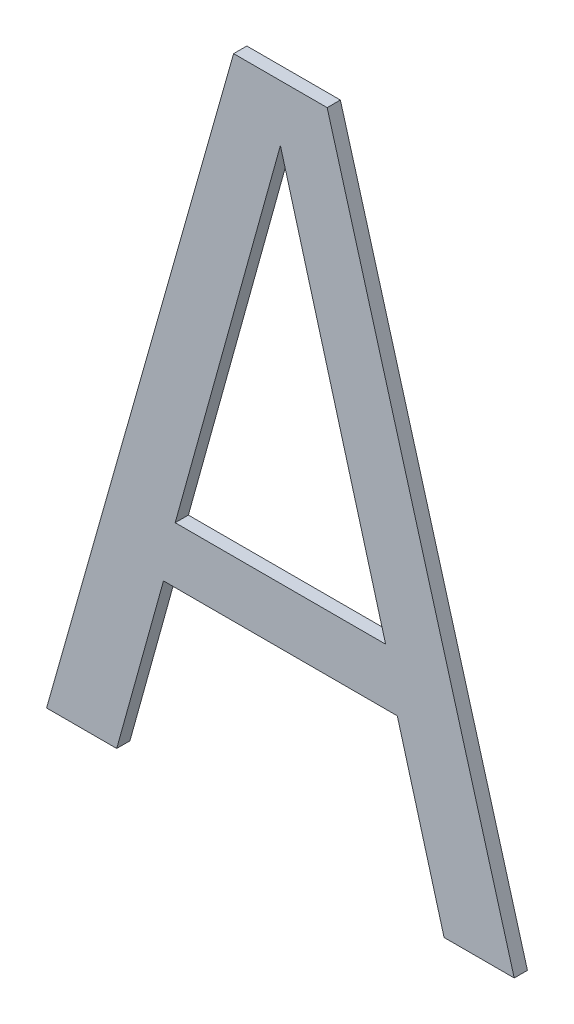
ISO-10303-21;
HEADER;
FILE_DESCRIPTION(('STEP AP214'),'2;1');
FILE_NAME('part.step','',(''),(''),'','','');
FILE_SCHEMA(('AUTOMOTIVE_DESIGN { 1 0 10303 214 1 1 1 1 }'));
ENDSEC;
DATA;
#1=APPLICATION_CONTEXT('core data for automotive mechanical design processes');
#2=APPLICATION_PROTOCOL_DEFINITION('international standard','automotive_design',2000,#1);
#3=PRODUCT_CONTEXT('',#1,'mechanical');
#4=PRODUCT('Part','Part','',(#3));
#5=PRODUCT_RELATED_PRODUCT_CATEGORY('part','',(#4));
#6=PRODUCT_DEFINITION_FORMATION('','',#4);
#7=PRODUCT_DEFINITION_CONTEXT('part definition',#1,'design');
#8=PRODUCT_DEFINITION('design','',#6,#7);
#9=PRODUCT_DEFINITION_SHAPE('','',#8);
#10=(LENGTH_UNIT() NAMED_UNIT(*) SI_UNIT(.MILLI.,.METRE.));
#11=(NAMED_UNIT(*) PLANE_ANGLE_UNIT() SI_UNIT($,.RADIAN.));
#12=(NAMED_UNIT(*) SI_UNIT($,.STERADIAN.) SOLID_ANGLE_UNIT());
#13=UNCERTAINTY_MEASURE_WITH_UNIT(LENGTH_MEASURE(1.E-05),#10,'distance_accuracy_value','');
#14=(GEOMETRIC_REPRESENTATION_CONTEXT(3) GLOBAL_UNCERTAINTY_ASSIGNED_CONTEXT((#13)) GLOBAL_UNIT_ASSIGNED_CONTEXT((#10,
#11,#12)) REPRESENTATION_CONTEXT('',''));
#15=CARTESIAN_POINT('',(0.,0.,0.));
#16=DIRECTION('',(0.,0.,1.));
#17=DIRECTION('',(1.,0.,0.));
#18=AXIS2_PLACEMENT_3D('',#15,#16,#17);
#19=CARTESIAN_POINT('',(157.622942385733,142.200586634191,5.9));
#20=DIRECTION('',(0.,0.,1.));
#21=DIRECTION('',(1.,0.,0.));
#22=AXIS2_PLACEMENT_3D('',#19,#20,#21);
#23=PLANE('',#22);
#24=DIRECTION('',(1.,0.,0.));
#25=VECTOR('',#24,1.);
#26=CARTESIAN_POINT('',(157.622942385733,143.902714239871,5.9));
#27=LINE('',#26,#25);
#28=CARTESIAN_POINT('',(159.688914575803,143.902714239871,5.9));
#29=VERTEX_POINT('',#28);
#30=CARTESIAN_POINT('',(158.095164575803,143.902714239871,5.9));
#31=VERTEX_POINT('',#30);
#32=EDGE_CURVE('E20',#29,#31,#27,.F.);
#33=ORIENTED_EDGE('',*,*,#32,.F.);
#34=DIRECTION('',(-0.267333223456103,0.963604144675898,0.));
#35=VECTOR('',#34,1.);
#36=CARTESIAN_POINT('',(158.892039575803,146.775054770021,5.9));
#37=LINE('',#36,#35);
#38=CARTESIAN_POINT('',(158.892039575803,146.775054770021,5.9));
#39=VERTEX_POINT('',#38);
#40=EDGE_CURVE('E154',#29,#39,#37,.T.);
#41=ORIENTED_EDGE('',*,*,#40,.T.);
#42=DIRECTION('',(-0.267333223456101,-0.963604144675899,0.));
#43=VECTOR('',#42,1.);
#44=CARTESIAN_POINT('',(158.095164575803,143.902714239871,5.9));
#45=LINE('',#44,#43);
#46=EDGE_CURVE('E149',#39,#31,#45,.T.);
#47=ORIENTED_EDGE('',*,*,#46,.T.);
#48=EDGE_LOOP('',(#33,#41,#47));
#49=FACE_BOUND('',#48,.T.);
#50=DIRECTION('',(0.272602692783405,0.962126692222618,0.));
#51=VECTOR('',#50,1.);
#52=CARTESIAN_POINT('',(158.537873246893,147.200586634191,5.9));
#53=LINE('',#52,#51);
#54=CARTESIAN_POINT('',(157.121205904708,142.200586634193,5.9));
#55=VERTEX_POINT('',#54);
#56=CARTESIAN_POINT('',(158.537873246893,147.200586634191,5.9));
#57=VERTEX_POINT('',#56);
#58=EDGE_CURVE('E147',#55,#57,#53,.T.);
#59=ORIENTED_EDGE('',*,*,#58,.T.);
#60=DIRECTION('',(1.,0.,0.));
#61=VECTOR('',#60,1.);
#62=CARTESIAN_POINT('',(159.246205904713,147.200586634191,5.9));
#63=LINE('',#62,#61);
#64=CARTESIAN_POINT('',(159.246205904713,147.200586634191,5.9));
#65=VERTEX_POINT('',#64);
#66=EDGE_CURVE('E141',#57,#65,#63,.T.);
#67=ORIENTED_EDGE('',*,*,#66,.T.);
#68=DIRECTION('',(0.272602692782372,-0.962126692222911,0.));
#69=VECTOR('',#68,1.);
#70=CARTESIAN_POINT('',(160.662873246893,142.200586634191,5.9));
#71=LINE('',#70,#69);
#72=CARTESIAN_POINT('',(160.662873246893,142.200586634191,5.9));
#73=VERTEX_POINT('',#72);
#74=EDGE_CURVE('E136',#65,#73,#71,.T.);
#75=ORIENTED_EDGE('',*,*,#74,.T.);
#76=DIRECTION('',(1.,0.,0.));
#77=VECTOR('',#76,1.);
#78=CARTESIAN_POINT('',(160.131623246893,142.200586634191,5.9));
#79=LINE('',#78,#77);
#80=CARTESIAN_POINT('',(160.131623246893,142.200586634191,5.9));
#81=VERTEX_POINT('',#80);
#82=EDGE_CURVE('E131',#73,#81,#79,.F.);
#83=ORIENTED_EDGE('',*,*,#82,.T.);
#84=DIRECTION('',(-0.26733370656626,0.963604010646253,0.));
#85=VECTOR('',#84,1.);
#86=CARTESIAN_POINT('',(159.777455904713,143.477182375701,5.9));
#87=LINE('',#86,#85);
#88=CARTESIAN_POINT('',(159.777455904713,143.477182375701,5.9));
#89=VERTEX_POINT('',#88);
#90=EDGE_CURVE('E127',#81,#89,#87,.T.);
#91=ORIENTED_EDGE('',*,*,#90,.T.);
#92=DIRECTION('',(1.,0.,0.));
#93=VECTOR('',#92,1.);
#94=CARTESIAN_POINT('',(158.006623246893,143.477182375701,5.9));
#95=LINE('',#94,#93);
#96=CARTESIAN_POINT('',(158.006623246893,143.477182375701,5.9));
#97=VERTEX_POINT('',#96);
#98=EDGE_CURVE('E113',#89,#97,#95,.F.);
#99=ORIENTED_EDGE('',*,*,#98,.T.);
#100=DIRECTION('',(-0.267333706566255,-0.963604010646255,0.));
#101=VECTOR('',#100,1.);
#102=CARTESIAN_POINT('',(157.652455904713,142.200586634191,5.9));
#103=LINE('',#102,#101);
#104=CARTESIAN_POINT('',(157.652455904713,142.200586634192,5.9));
#105=VERTEX_POINT('',#104);
#106=EDGE_CURVE('E98',#97,#105,#103,.T.);
#107=ORIENTED_EDGE('',*,*,#106,.T.);
#108=DIRECTION('',(1.,0.,0.));
#109=VECTOR('',#108,1.);
#110=CARTESIAN_POINT('',(157.121205904708,142.200586634193,5.9));
#111=LINE('',#110,#109);
#112=EDGE_CURVE('E103',#105,#55,#111,.F.);
#113=ORIENTED_EDGE('',*,*,#112,.T.);
#114=EDGE_LOOP('',(#59,#67,#75,#83,#91,#99,#107,#113));
#115=FACE_BOUND('',#114,.T.);
#116=ADVANCED_FACE('F17',(#49,#115),#23,.F.);
#117=CARTESIAN_POINT('',(157.121205904708,142.200586634193,6.));
#118=DIRECTION('',(0.,1.,0.));
#119=DIRECTION('',(0.,0.,1.));
#120=AXIS2_PLACEMENT_3D('',#117,#118,#119);
#121=PLANE('',#120);
#122=DIRECTION('',(0.,0.,1.));
#123=VECTOR('',#122,1.);
#124=CARTESIAN_POINT('',(157.652455904713,142.200586634191,6.));
#125=LINE('',#124,#123);
#126=CARTESIAN_POINT('',(157.652455904713,142.200586634192,6.));
#127=VERTEX_POINT('',#126);
#128=EDGE_CURVE('E105',#105,#127,#125,.T.);
#129=ORIENTED_EDGE('',*,*,#128,.T.);
#130=DIRECTION('',(1.,0.,0.));
#131=VECTOR('',#130,1.);
#132=CARTESIAN_POINT('',(157.622942385733,142.200586634193,6.));
#133=LINE('',#132,#131);
#134=CARTESIAN_POINT('',(157.121205904708,142.200586634193,6.));
#135=VERTEX_POINT('',#134);
#136=EDGE_CURVE('E161',#135,#127,#133,.T.);
#137=ORIENTED_EDGE('',*,*,#136,.F.);
#138=DIRECTION('',(0.,0.,1.));
#139=VECTOR('',#138,1.);
#140=CARTESIAN_POINT('',(157.121205904708,142.200586634193,6.));
#141=LINE('',#140,#139);
#142=EDGE_CURVE('E108',#135,#55,#141,.F.);
#143=ORIENTED_EDGE('',*,*,#142,.T.);
#144=ORIENTED_EDGE('',*,*,#112,.F.);
#145=EDGE_LOOP('',(#129,#137,#143,#144));
#146=FACE_BOUND('',#145,.T.);
#147=ADVANCED_FACE('F104',(#146),#121,.F.);
#148=CARTESIAN_POINT('',(157.652455904713,142.200586634191,6.));
#149=DIRECTION('',(-0.963604010646255,0.267333706566255,0.));
#150=DIRECTION('',(-0.267333706566255,-0.963604010646255,0.));
#151=AXIS2_PLACEMENT_3D('',#148,#149,#150);
#152=PLANE('',#151);
#153=DIRECTION('',(0.,0.,1.));
#154=VECTOR('',#153,1.);
#155=CARTESIAN_POINT('',(158.006623246893,143.477182375701,6.));
#156=LINE('',#155,#154);
#157=CARTESIAN_POINT('',(158.006623246893,143.477182375701,6.));
#158=VERTEX_POINT('',#157);
#159=EDGE_CURVE('E115',#97,#158,#156,.T.);
#160=ORIENTED_EDGE('',*,*,#159,.T.);
#161=DIRECTION('',(0.26733370656626,0.963604010646253,0.));
#162=VECTOR('',#161,1.);
#163=CARTESIAN_POINT('',(157.652455904713,142.200586634191,6.));
#164=LINE('',#163,#162);
#165=EDGE_CURVE('E119',#127,#158,#164,.T.);
#166=ORIENTED_EDGE('',*,*,#165,.F.);
#167=ORIENTED_EDGE('',*,*,#128,.F.);
#168=ORIENTED_EDGE('',*,*,#106,.F.);
#169=EDGE_LOOP('',(#160,#166,#167,#168));
#170=FACE_BOUND('',#169,.T.);
#171=ADVANCED_FACE('F117',(#170),#152,.F.);
#172=CARTESIAN_POINT('',(158.006623246893,143.477182375701,6.));
#173=DIRECTION('',(0.,1.,0.));
#174=DIRECTION('',(0.,0.,1.));
#175=AXIS2_PLACEMENT_3D('',#172,#173,#174);
#176=PLANE('',#175);
#177=DIRECTION('',(0.,0.,1.));
#178=VECTOR('',#177,1.);
#179=CARTESIAN_POINT('',(159.777455904713,143.477182375701,6.));
#180=LINE('',#179,#178);
#181=CARTESIAN_POINT('',(159.777455904713,143.477182375701,6.));
#182=VERTEX_POINT('',#181);
#183=EDGE_CURVE('E125',#89,#182,#180,.T.);
#184=ORIENTED_EDGE('',*,*,#183,.T.);
#185=DIRECTION('',(1.,0.,0.));
#186=VECTOR('',#185,1.);
#187=CARTESIAN_POINT('',(157.622942385733,143.477182375701,6.));
#188=LINE('',#187,#186);
#189=EDGE_CURVE('E164',#158,#182,#188,.T.);
#190=ORIENTED_EDGE('',*,*,#189,.F.);
#191=ORIENTED_EDGE('',*,*,#159,.F.);
#192=ORIENTED_EDGE('',*,*,#98,.F.);
#193=EDGE_LOOP('',(#184,#190,#191,#192));
#194=FACE_BOUND('',#193,.T.);
#195=ADVANCED_FACE('F228',(#194),#176,.F.);
#196=CARTESIAN_POINT('',(159.777455904713,143.477182375701,6.));
#197=DIRECTION('',(0.963604010646253,0.26733370656626,0.));
#198=DIRECTION('',(-0.26733370656626,0.963604010646253,0.));
#199=AXIS2_PLACEMENT_3D('',#196,#197,#198);
#200=PLANE('',#199);
#201=DIRECTION('',(0.,0.,1.));
#202=VECTOR('',#201,1.);
#203=CARTESIAN_POINT('',(160.131623246893,142.200586634191,6.));
#204=LINE('',#203,#202);
#205=CARTESIAN_POINT('',(160.131623246893,142.200586634191,6.));
#206=VERTEX_POINT('',#205);
#207=EDGE_CURVE('E129',#81,#206,#204,.T.);
#208=ORIENTED_EDGE('',*,*,#207,.T.);
#209=DIRECTION('',(0.26733370656628,-0.963604010646248,0.));
#210=VECTOR('',#209,1.);
#211=CARTESIAN_POINT('',(159.777455904713,143.477182375701,6.));
#212=LINE('',#211,#210);
#213=EDGE_CURVE('E167',#182,#206,#212,.T.);
#214=ORIENTED_EDGE('',*,*,#213,.F.);
#215=ORIENTED_EDGE('',*,*,#183,.F.);
#216=ORIENTED_EDGE('',*,*,#90,.F.);
#217=EDGE_LOOP('',(#208,#214,#215,#216));
#218=FACE_BOUND('',#217,.T.);
#219=ADVANCED_FACE('F224',(#218),#200,.F.);
#220=CARTESIAN_POINT('',(160.131623246893,142.200586634191,6.));
#221=DIRECTION('',(0.,1.,0.));
#222=DIRECTION('',(0.,0.,1.));
#223=AXIS2_PLACEMENT_3D('',#220,#221,#222);
#224=PLANE('',#223);
#225=DIRECTION('',(0.,0.,1.));
#226=VECTOR('',#225,1.);
#227=CARTESIAN_POINT('',(160.662873246893,142.200586634191,6.));
#228=LINE('',#227,#226);
#229=CARTESIAN_POINT('',(160.662873246893,142.200586634191,6.));
#230=VERTEX_POINT('',#229);
#231=EDGE_CURVE('E134',#73,#230,#228,.T.);
#232=ORIENTED_EDGE('',*,*,#231,.T.);
#233=DIRECTION('',(1.,0.,0.));
#234=VECTOR('',#233,1.);
#235=CARTESIAN_POINT('',(157.622942385733,142.200586634191,6.));
#236=LINE('',#235,#234);
#237=EDGE_CURVE('E170',#206,#230,#236,.T.);
#238=ORIENTED_EDGE('',*,*,#237,.F.);
#239=ORIENTED_EDGE('',*,*,#207,.F.);
#240=ORIENTED_EDGE('',*,*,#82,.F.);
#241=EDGE_LOOP('',(#232,#238,#239,#240));
#242=FACE_BOUND('',#241,.T.);
#243=ADVANCED_FACE('F220',(#242),#224,.F.);
#244=CARTESIAN_POINT('',(160.662873246893,142.200586634191,6.));
#245=DIRECTION('',(-0.962126692222911,-0.272602692782372,0.));
#246=DIRECTION('',(0.272602692782372,-0.962126692222911,0.));
#247=AXIS2_PLACEMENT_3D('',#244,#245,#246);
#248=PLANE('',#247);
#249=DIRECTION('',(0.,0.,-1.));
#250=VECTOR('',#249,1.);
#251=CARTESIAN_POINT('',(159.246205904713,147.200586634191,6.));
#252=LINE('',#251,#250);
#253=CARTESIAN_POINT('',(159.246205904713,147.200586634191,6.));
#254=VERTEX_POINT('',#253);
#255=EDGE_CURVE('E139',#65,#254,#252,.F.);
#256=ORIENTED_EDGE('',*,*,#255,.T.);
#257=DIRECTION('',(-0.272602692782371,0.962126692222911,0.));
#258=VECTOR('',#257,1.);
#259=CARTESIAN_POINT('',(160.662873246893,142.200586634191,6.));
#260=LINE('',#259,#258);
#261=EDGE_CURVE('E173',#230,#254,#260,.T.);
#262=ORIENTED_EDGE('',*,*,#261,.F.);
#263=ORIENTED_EDGE('',*,*,#231,.F.);
#264=ORIENTED_EDGE('',*,*,#74,.F.);
#265=EDGE_LOOP('',(#256,#262,#263,#264));
#266=FACE_BOUND('',#265,.T.);
#267=ADVANCED_FACE('F216',(#266),#248,.F.);
#268=CARTESIAN_POINT('',(159.246205904713,147.200586634191,6.));
#269=DIRECTION('',(0.,-1.,0.));
#270=DIRECTION('',(0.,0.,-1.));
#271=AXIS2_PLACEMENT_3D('',#268,#269,#270);
#272=PLANE('',#271);
#273=DIRECTION('',(0.,0.,1.));
#274=VECTOR('',#273,1.);
#275=CARTESIAN_POINT('',(158.537873246893,147.200586634191,6.));
#276=LINE('',#275,#274);
#277=CARTESIAN_POINT('',(158.537873246893,147.200586634191,6.));
#278=VERTEX_POINT('',#277);
#279=EDGE_CURVE('E144',#57,#278,#276,.T.);
#280=ORIENTED_EDGE('',*,*,#279,.T.);
#281=DIRECTION('',(1.,0.,0.));
#282=VECTOR('',#281,1.);
#283=CARTESIAN_POINT('',(157.622942385733,147.200586634191,6.));
#284=LINE('',#283,#282);
#285=EDGE_CURVE('E176',#254,#278,#284,.F.);
#286=ORIENTED_EDGE('',*,*,#285,.F.);
#287=ORIENTED_EDGE('',*,*,#255,.F.);
#288=ORIENTED_EDGE('',*,*,#66,.F.);
#289=EDGE_LOOP('',(#280,#286,#287,#288));
#290=FACE_BOUND('',#289,.T.);
#291=ADVANCED_FACE('F212',(#290),#272,.F.);
#292=CARTESIAN_POINT('',(158.537873246893,147.200586634191,6.));
#293=DIRECTION('',(0.962126692222618,-0.272602692783405,0.));
#294=DIRECTION('',(0.272602692783405,0.962126692222618,0.));
#295=AXIS2_PLACEMENT_3D('',#292,#293,#294);
#296=PLANE('',#295);
#297=ORIENTED_EDGE('',*,*,#142,.F.);
#298=DIRECTION('',(-0.272602692783411,-0.962126692222616,0.));
#299=VECTOR('',#298,1.);
#300=CARTESIAN_POINT('',(158.537873246893,147.200586634191,6.));
#301=LINE('',#300,#299);
#302=EDGE_CURVE('E179',#278,#135,#301,.T.);
#303=ORIENTED_EDGE('',*,*,#302,.F.);
#304=ORIENTED_EDGE('',*,*,#279,.F.);
#305=ORIENTED_EDGE('',*,*,#58,.F.);
#306=EDGE_LOOP('',(#297,#303,#304,#305));
#307=FACE_BOUND('',#306,.T.);
#308=ADVANCED_FACE('F209',(#307),#296,.F.);
#309=CARTESIAN_POINT('',(158.095164575803,143.902714239871,6.));
#310=DIRECTION('',(-0.963604144675899,0.267333223456101,0.));
#311=DIRECTION('',(-0.267333223456101,-0.963604144675899,0.));
#312=AXIS2_PLACEMENT_3D('',#309,#310,#311);
#313=PLANE('',#312);
#314=DIRECTION('',(0.,0.,1.));
#315=VECTOR('',#314,1.);
#316=CARTESIAN_POINT('',(158.892039575803,146.775054770021,6.));
#317=LINE('',#316,#315);
#318=CARTESIAN_POINT('',(158.892039575803,146.775054770021,6.));
#319=VERTEX_POINT('',#318);
#320=EDGE_CURVE('E152',#39,#319,#317,.T.);
#321=ORIENTED_EDGE('',*,*,#320,.T.);
#322=DIRECTION('',(0.267333223456104,0.963604144675898,0.));
#323=VECTOR('',#322,1.);
#324=CARTESIAN_POINT('',(158.095164575803,143.902714239871,6.));
#325=LINE('',#324,#323);
#326=CARTESIAN_POINT('',(158.095164575803,143.902714239871,6.));
#327=VERTEX_POINT('',#326);
#328=EDGE_CURVE('E182',#327,#319,#325,.T.);
#329=ORIENTED_EDGE('',*,*,#328,.F.);
#330=DIRECTION('',(0.,0.,-1.));
#331=VECTOR('',#330,1.);
#332=CARTESIAN_POINT('',(158.095164575803,143.902714239871,6.));
#333=LINE('',#332,#331);
#334=EDGE_CURVE('E158',#327,#31,#333,.T.);
#335=ORIENTED_EDGE('',*,*,#334,.T.);
#336=ORIENTED_EDGE('',*,*,#46,.F.);
#337=EDGE_LOOP('',(#321,#329,#335,#336));
#338=FACE_BOUND('',#337,.T.);
#339=ADVANCED_FACE('F192',(#338),#313,.F.);
#340=CARTESIAN_POINT('',(158.892039575803,146.775054770021,6.));
#341=DIRECTION('',(0.963604144675898,0.267333223456103,0.));
#342=DIRECTION('',(-0.267333223456103,0.963604144675898,0.));
#343=AXIS2_PLACEMENT_3D('',#340,#341,#342);
#344=PLANE('',#343);
#345=DIRECTION('',(0.,0.,-1.));
#346=VECTOR('',#345,1.);
#347=CARTESIAN_POINT('',(159.688914575803,143.902714239871,6.));
#348=LINE('',#347,#346);
#349=CARTESIAN_POINT('',(159.688914575803,143.902714239871,6.));
#350=VERTEX_POINT('',#349);
#351=EDGE_CURVE('E35',#29,#350,#348,.F.);
#352=ORIENTED_EDGE('',*,*,#351,.T.);
#353=DIRECTION('',(0.267333223456104,-0.963604144675898,0.));
#354=VECTOR('',#353,1.);
#355=CARTESIAN_POINT('',(158.892039575803,146.775054770021,6.));
#356=LINE('',#355,#354);
#357=EDGE_CURVE('E26',#319,#350,#356,.T.);
#358=ORIENTED_EDGE('',*,*,#357,.F.);
#359=ORIENTED_EDGE('',*,*,#320,.F.);
#360=ORIENTED_EDGE('',*,*,#40,.F.);
#361=EDGE_LOOP('',(#352,#358,#359,#360));
#362=FACE_BOUND('',#361,.T.);
#363=ADVANCED_FACE('F190',(#362),#344,.F.);
#364=CARTESIAN_POINT('',(159.688914575803,143.902714239871,6.));
#365=DIRECTION('',(0.,-1.,0.));
#366=DIRECTION('',(0.,0.,-1.));
#367=AXIS2_PLACEMENT_3D('',#364,#365,#366);
#368=PLANE('',#367);
#369=ORIENTED_EDGE('',*,*,#334,.F.);
#370=DIRECTION('',(1.,0.,0.));
#371=VECTOR('',#370,1.);
#372=CARTESIAN_POINT('',(157.622942385733,143.902714239871,6.));
#373=LINE('',#372,#371);
#374=EDGE_CURVE('E11',#350,#327,#373,.F.);
#375=ORIENTED_EDGE('',*,*,#374,.F.);
#376=ORIENTED_EDGE('',*,*,#351,.F.);
#377=ORIENTED_EDGE('',*,*,#32,.T.);
#378=EDGE_LOOP('',(#369,#375,#376,#377));
#379=FACE_BOUND('',#378,.T.);
#380=ADVANCED_FACE('F196',(#379),#368,.F.);
#381=CARTESIAN_POINT('',(157.622942385733,142.200586634191,6.));
#382=DIRECTION('',(0.,0.,1.));
#383=DIRECTION('',(1.,0.,0.));
#384=AXIS2_PLACEMENT_3D('',#381,#382,#383);
#385=PLANE('',#384);
#386=ORIENTED_EDGE('',*,*,#357,.T.);
#387=ORIENTED_EDGE('',*,*,#374,.T.);
#388=ORIENTED_EDGE('',*,*,#328,.T.);
#389=EDGE_LOOP('',(#386,#387,#388));
#390=FACE_BOUND('',#389,.T.);
#391=ORIENTED_EDGE('',*,*,#285,.T.);
#392=ORIENTED_EDGE('',*,*,#302,.T.);
#393=ORIENTED_EDGE('',*,*,#136,.T.);
#394=ORIENTED_EDGE('',*,*,#165,.T.);
#395=ORIENTED_EDGE('',*,*,#189,.T.);
#396=ORIENTED_EDGE('',*,*,#213,.T.);
#397=ORIENTED_EDGE('',*,*,#237,.T.);
#398=ORIENTED_EDGE('',*,*,#261,.T.);
#399=EDGE_LOOP('',(#391,#392,#393,#394,#395,#396,#397,#398));
#400=FACE_BOUND('',#399,.T.);
#401=ADVANCED_FACE('F187',(#390,#400),#385,.T.);
#402=CLOSED_SHELL('',(#116,#147,#171,#195,#219,#243,#267,#291,#308,#339,#363,#380,#401));
#403=MANIFOLD_SOLID_BREP('B1',#402);
#404=ADVANCED_BREP_SHAPE_REPRESENTATION('',(#18,#403),#14);
#405=SHAPE_DEFINITION_REPRESENTATION(#9,#404);
ENDSEC;
END-ISO-10303-21;
